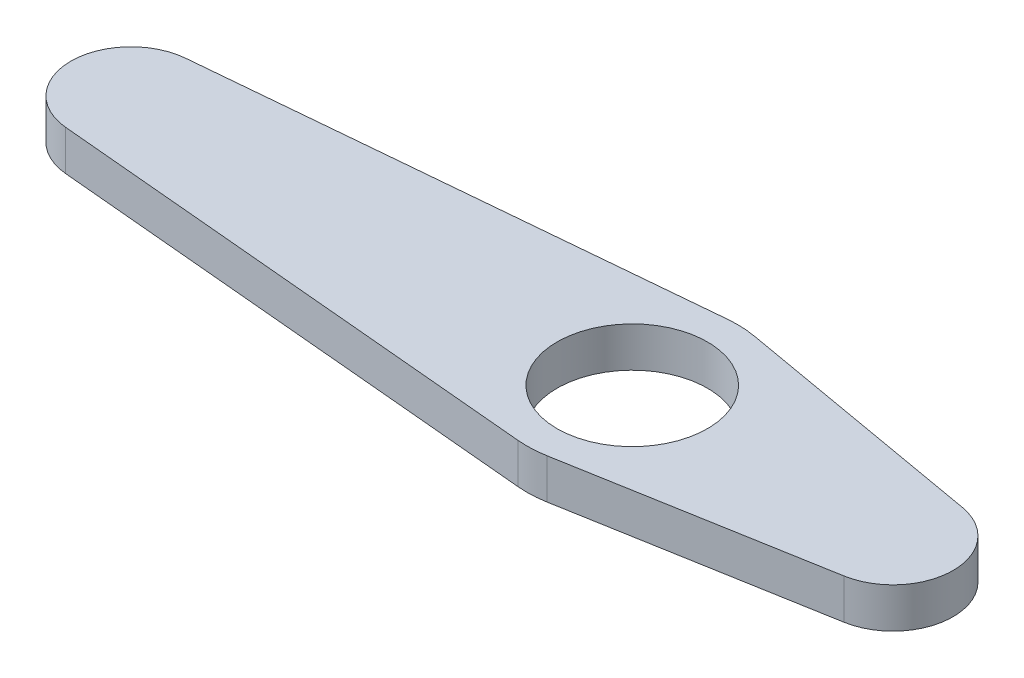
ISO-10303-21;
HEADER;
FILE_DESCRIPTION(('STEP AP214'),'2;1');
FILE_NAME('part.step','',(''),(''),'','','');
FILE_SCHEMA(('AUTOMOTIVE_DESIGN { 1 0 10303 214 1 1 1 1 }'));
ENDSEC;
DATA;
#1=APPLICATION_CONTEXT('core data for automotive mechanical design processes');
#2=APPLICATION_PROTOCOL_DEFINITION('international standard','automotive_design',2000,#1);
#3=PRODUCT_CONTEXT('',#1,'mechanical');
#4=PRODUCT('Part','Part','',(#3));
#5=PRODUCT_RELATED_PRODUCT_CATEGORY('part','',(#4));
#6=PRODUCT_DEFINITION_FORMATION('','',#4);
#7=PRODUCT_DEFINITION_CONTEXT('part definition',#1,'design');
#8=PRODUCT_DEFINITION('design','',#6,#7);
#9=PRODUCT_DEFINITION_SHAPE('','',#8);
#10=(LENGTH_UNIT() NAMED_UNIT(*) SI_UNIT(.MILLI.,.METRE.));
#11=(NAMED_UNIT(*) PLANE_ANGLE_UNIT() SI_UNIT($,.RADIAN.));
#12=(NAMED_UNIT(*) SI_UNIT($,.STERADIAN.) SOLID_ANGLE_UNIT());
#13=UNCERTAINTY_MEASURE_WITH_UNIT(LENGTH_MEASURE(1.E-05),#10,'distance_accuracy_value','');
#14=(GEOMETRIC_REPRESENTATION_CONTEXT(3) GLOBAL_UNCERTAINTY_ASSIGNED_CONTEXT((#13)) GLOBAL_UNIT_ASSIGNED_CONTEXT((#10,
#11,#12)) REPRESENTATION_CONTEXT('',''));
#15=CARTESIAN_POINT('',(0.,0.,0.));
#16=DIRECTION('',(0.,0.,1.));
#17=DIRECTION('',(1.,0.,0.));
#18=AXIS2_PLACEMENT_3D('',#15,#16,#17);
#19=CARTESIAN_POINT('',(-25.,1.,0.));
#20=DIRECTION('',(0.,-1.,0.));
#21=DIRECTION('',(0.,0.,-1.));
#22=AXIS2_PLACEMENT_3D('',#19,#20,#21);
#23=PLANE('',#22);
#24=CARTESIAN_POINT('',(-25.,1.,0.));
#25=DIRECTION('',(0.,1.,0.));
#26=DIRECTION('',(0.,0.,-1.));
#27=AXIS2_PLACEMENT_3D('',#24,#25,#26);
#28=CIRCLE('',#27,3.);
#29=CARTESIAN_POINT('',(-25.27,1.,-2.98782529609748));
#30=VERTEX_POINT('',#29);
#31=CARTESIAN_POINT('',(-25.27,1.,2.98782529609748));
#32=VERTEX_POINT('',#31);
#33=EDGE_CURVE('E151',#30,#32,#28,.T.);
#34=ORIENTED_EDGE('',*,*,#33,.T.);
#35=DIRECTION('',(0.995941765365827,0.,0.09));
#36=VECTOR('',#35,1.);
#37=CARTESIAN_POINT('',(-25.27,1.,2.98782529609748));
#38=LINE('',#37,#36);
#39=CARTESIAN_POINT('',(-0.4725,1.,5.22869426817059));
#40=VERTEX_POINT('',#39);
#41=EDGE_CURVE('E99',#32,#40,#38,.T.);
#42=ORIENTED_EDGE('',*,*,#41,.T.);
#43=CARTESIAN_POINT('',(0.,1.,0.));
#44=DIRECTION('',(0.,1.,0.));
#45=DIRECTION('',(0.,0.,1.));
#46=AXIS2_PLACEMENT_3D('',#43,#44,#45);
#47=CIRCLE('',#46,5.25);
#48=CARTESIAN_POINT('',(0.908653846153847,1.,5.17076862641038));
#49=VERTEX_POINT('',#48);
#50=EDGE_CURVE('E166',#40,#49,#47,.T.);
#51=ORIENTED_EDGE('',*,*,#50,.T.);
#52=DIRECTION('',(0.984908309792452,0.,-0.173076923076924));
#53=VECTOR('',#52,1.);
#54=CARTESIAN_POINT('',(0.90865384615385,1.,5.17076862641038));
#55=LINE('',#54,#53);
#56=CARTESIAN_POINT('',(13.5192307692308,1.,2.95472492937736));
#57=VERTEX_POINT('',#56);
#58=EDGE_CURVE('E179',#49,#57,#55,.T.);
#59=ORIENTED_EDGE('',*,*,#58,.T.);
#60=CARTESIAN_POINT('',(13.,1.,0.));
#61=DIRECTION('',(0.,1.,0.));
#62=DIRECTION('',(0.,0.,-1.));
#63=AXIS2_PLACEMENT_3D('',#60,#61,#62);
#64=CIRCLE('',#63,3.);
#65=CARTESIAN_POINT('',(13.5192307692308,1.,-2.95472492937736));
#66=VERTEX_POINT('',#65);
#67=EDGE_CURVE('E118',#57,#66,#64,.T.);
#68=ORIENTED_EDGE('',*,*,#67,.T.);
#69=DIRECTION('',(-0.984908309792452,0.,-0.173076923076923));
#70=VECTOR('',#69,1.);
#71=CARTESIAN_POINT('',(0.908653846153846,1.,-5.17076862641037));
#72=LINE('',#71,#70);
#73=CARTESIAN_POINT('',(0.908653846153846,1.,-5.17076862641037));
#74=VERTEX_POINT('',#73);
#75=EDGE_CURVE('E112',#66,#74,#72,.T.);
#76=ORIENTED_EDGE('',*,*,#75,.T.);
#77=CARTESIAN_POINT('',(0.,1.,0.));
#78=DIRECTION('',(0.,1.,0.));
#79=DIRECTION('',(0.,0.,-1.));
#80=AXIS2_PLACEMENT_3D('',#77,#78,#79);
#81=CIRCLE('',#80,5.25);
#82=CARTESIAN_POINT('',(-0.472500000000002,1.,-5.22869426817059));
#83=VERTEX_POINT('',#82);
#84=EDGE_CURVE('E116',#74,#83,#81,.T.);
#85=ORIENTED_EDGE('',*,*,#84,.T.);
#86=DIRECTION('',(-0.995941765365827,0.,0.09));
#87=VECTOR('',#86,1.);
#88=CARTESIAN_POINT('',(-0.472499999999999,1.,-5.22869426817059));
#89=LINE('',#88,#87);
#90=EDGE_CURVE('E56',#83,#30,#89,.T.);
#91=ORIENTED_EDGE('',*,*,#90,.T.);
#92=EDGE_LOOP('',(#34,#42,#51,#59,#68,#76,#85,#91));
#93=FACE_BOUND('',#92,.T.);
#94=CARTESIAN_POINT('',(0.,1.,0.));
#95=DIRECTION('',(0.,1.,0.));
#96=DIRECTION('',(0.,0.,1.));
#97=AXIS2_PLACEMENT_3D('',#94,#95,#96);
#98=CIRCLE('',#97,3.75);
#99=CARTESIAN_POINT('',(0.,1.,3.75));
#100=VERTEX_POINT('',#99);
#101=EDGE_CURVE('E140',#100,#100,#98,.T.);
#102=ORIENTED_EDGE('',*,*,#101,.F.);
#103=EDGE_LOOP('',(#102));
#104=FACE_BOUND('',#103,.T.);
#105=ADVANCED_FACE('F39',(#93,#104),#23,.F.);
#106=CARTESIAN_POINT('',(-25.,-1.,0.));
#107=DIRECTION('',(0.,-1.,0.));
#108=DIRECTION('',(0.,0.,-1.));
#109=AXIS2_PLACEMENT_3D('',#106,#107,#108);
#110=PLANE('',#109);
#111=CARTESIAN_POINT('',(-25.,-1.,0.));
#112=DIRECTION('',(0.,1.,0.));
#113=DIRECTION('',(0.,0.,-1.));
#114=AXIS2_PLACEMENT_3D('',#111,#112,#113);
#115=CIRCLE('',#114,3.);
#116=CARTESIAN_POINT('',(-25.27,-1.,-2.98782529609748));
#117=VERTEX_POINT('',#116);
#118=CARTESIAN_POINT('',(-25.27,-1.,2.98782529609748));
#119=VERTEX_POINT('',#118);
#120=EDGE_CURVE('E136',#117,#119,#115,.T.);
#121=ORIENTED_EDGE('',*,*,#120,.F.);
#122=DIRECTION('',(-0.995941765365827,0.,0.09));
#123=VECTOR('',#122,1.);
#124=CARTESIAN_POINT('',(-0.472499999999999,-1.,-5.22869426817059));
#125=LINE('',#124,#123);
#126=CARTESIAN_POINT('',(-0.472500000000002,-1.,-5.22869426817059));
#127=VERTEX_POINT('',#126);
#128=EDGE_CURVE('E91',#127,#117,#125,.T.);
#129=ORIENTED_EDGE('',*,*,#128,.F.);
#130=CARTESIAN_POINT('',(0.,-1.,0.));
#131=DIRECTION('',(0.,1.,0.));
#132=DIRECTION('',(0.,0.,-1.));
#133=AXIS2_PLACEMENT_3D('',#130,#131,#132);
#134=CIRCLE('',#133,5.25);
#135=CARTESIAN_POINT('',(0.908653846153846,-1.,-5.17076862641037));
#136=VERTEX_POINT('',#135);
#137=EDGE_CURVE('E85',#136,#127,#134,.T.);
#138=ORIENTED_EDGE('',*,*,#137,.F.);
#139=DIRECTION('',(-0.984908309792452,0.,-0.173076923076923));
#140=VECTOR('',#139,1.);
#141=CARTESIAN_POINT('',(0.908653846153846,-1.,-5.17076862641037));
#142=LINE('',#141,#140);
#143=CARTESIAN_POINT('',(13.5192307692308,-1.,-2.95472492937736));
#144=VERTEX_POINT('',#143);
#145=EDGE_CURVE('E126',#144,#136,#142,.T.);
#146=ORIENTED_EDGE('',*,*,#145,.F.);
#147=CARTESIAN_POINT('',(13.,-1.,0.));
#148=DIRECTION('',(0.,1.,0.));
#149=DIRECTION('',(0.,0.,-1.));
#150=AXIS2_PLACEMENT_3D('',#147,#148,#149);
#151=CIRCLE('',#150,3.);
#152=CARTESIAN_POINT('',(13.5192307692308,-1.,2.95472492937736));
#153=VERTEX_POINT('',#152);
#154=EDGE_CURVE('E146',#153,#144,#151,.T.);
#155=ORIENTED_EDGE('',*,*,#154,.F.);
#156=DIRECTION('',(0.984908309792452,0.,-0.173076923076924));
#157=VECTOR('',#156,1.);
#158=CARTESIAN_POINT('',(0.90865384615385,-1.,5.17076862641038));
#159=LINE('',#158,#157);
#160=CARTESIAN_POINT('',(0.908653846153847,-1.,5.17076862641038));
#161=VERTEX_POINT('',#160);
#162=EDGE_CURVE('E144',#161,#153,#159,.T.);
#163=ORIENTED_EDGE('',*,*,#162,.F.);
#164=CARTESIAN_POINT('',(0.,-1.,0.));
#165=DIRECTION('',(0.,1.,0.));
#166=DIRECTION('',(0.,0.,1.));
#167=AXIS2_PLACEMENT_3D('',#164,#165,#166);
#168=CIRCLE('',#167,5.25);
#169=CARTESIAN_POINT('',(-0.4725,-1.,5.22869426817059));
#170=VERTEX_POINT('',#169);
#171=EDGE_CURVE('E142',#170,#161,#168,.T.);
#172=ORIENTED_EDGE('',*,*,#171,.F.);
#173=DIRECTION('',(0.995941765365827,0.,0.09));
#174=VECTOR('',#173,1.);
#175=CARTESIAN_POINT('',(-25.27,-1.,2.98782529609748));
#176=LINE('',#175,#174);
#177=EDGE_CURVE('E139',#119,#170,#176,.T.);
#178=ORIENTED_EDGE('',*,*,#177,.F.);
#179=EDGE_LOOP('',(#121,#129,#138,#146,#155,#163,#172,#178));
#180=FACE_BOUND('',#179,.T.);
#181=CARTESIAN_POINT('',(0.,-1.,0.));
#182=DIRECTION('',(0.,1.,0.));
#183=DIRECTION('',(0.,0.,1.));
#184=AXIS2_PLACEMENT_3D('',#181,#182,#183);
#185=CIRCLE('',#184,3.75);
#186=CARTESIAN_POINT('',(0.,-1.,3.75));
#187=VERTEX_POINT('',#186);
#188=EDGE_CURVE('E185',#187,#187,#185,.T.);
#189=ORIENTED_EDGE('',*,*,#188,.T.);
#190=EDGE_LOOP('',(#189));
#191=FACE_BOUND('',#190,.T.);
#192=ADVANCED_FACE('F170',(#180,#191),#110,.T.);
#193=CARTESIAN_POINT('',(-25.,1.,0.));
#194=DIRECTION('',(0.,-1.,0.));
#195=DIRECTION('',(0.,0.,-1.));
#196=AXIS2_PLACEMENT_3D('',#193,#194,#195);
#197=CYLINDRICAL_SURFACE('',#196,3.);
#198=ORIENTED_EDGE('',*,*,#120,.T.);
#199=DIRECTION('',(0.,-1.,0.));
#200=VECTOR('',#199,1.);
#201=CARTESIAN_POINT('',(-25.27,1.,2.98782529609748));
#202=LINE('',#201,#200);
#203=EDGE_CURVE('E11',#32,#119,#202,.T.);
#204=ORIENTED_EDGE('',*,*,#203,.F.);
#205=ORIENTED_EDGE('',*,*,#33,.F.);
#206=DIRECTION('',(0.,-1.,0.));
#207=VECTOR('',#206,1.);
#208=CARTESIAN_POINT('',(-25.27,1.,-2.98782529609748));
#209=LINE('',#208,#207);
#210=EDGE_CURVE('E132',#30,#117,#209,.T.);
#211=ORIENTED_EDGE('',*,*,#210,.T.);
#212=EDGE_LOOP('',(#198,#204,#205,#211));
#213=FACE_BOUND('',#212,.T.);
#214=ADVANCED_FACE('F41',(#213),#197,.T.);
#215=CARTESIAN_POINT('',(-25.27,1.,2.98782529609748));
#216=DIRECTION('',(0.09,0.,-0.995941765365827));
#217=DIRECTION('',(-0.995941765365827,0.,-0.09));
#218=AXIS2_PLACEMENT_3D('',#215,#216,#217);
#219=PLANE('',#218);
#220=ORIENTED_EDGE('',*,*,#177,.T.);
#221=DIRECTION('',(0.,-1.,0.));
#222=VECTOR('',#221,1.);
#223=CARTESIAN_POINT('',(-0.4725,1.,5.22869426817059));
#224=LINE('',#223,#222);
#225=EDGE_CURVE('E48',#40,#170,#224,.T.);
#226=ORIENTED_EDGE('',*,*,#225,.F.);
#227=ORIENTED_EDGE('',*,*,#41,.F.);
#228=ORIENTED_EDGE('',*,*,#203,.T.);
#229=EDGE_LOOP('',(#220,#226,#227,#228));
#230=FACE_BOUND('',#229,.T.);
#231=ADVANCED_FACE('F213',(#230),#219,.F.);
#232=CARTESIAN_POINT('',(0.,1.,0.));
#233=DIRECTION('',(0.,-1.,0.));
#234=DIRECTION('',(0.,0.,-1.));
#235=AXIS2_PLACEMENT_3D('',#232,#233,#234);
#236=CYLINDRICAL_SURFACE('',#235,5.25);
#237=ORIENTED_EDGE('',*,*,#171,.T.);
#238=DIRECTION('',(0.,-1.,0.));
#239=VECTOR('',#238,1.);
#240=CARTESIAN_POINT('',(0.908653846153847,1.,5.17076862641038));
#241=LINE('',#240,#239);
#242=EDGE_CURVE('E158',#49,#161,#241,.T.);
#243=ORIENTED_EDGE('',*,*,#242,.F.);
#244=ORIENTED_EDGE('',*,*,#50,.F.);
#245=ORIENTED_EDGE('',*,*,#225,.T.);
#246=EDGE_LOOP('',(#237,#243,#244,#245));
#247=FACE_BOUND('',#246,.T.);
#248=ADVANCED_FACE('F164',(#247),#236,.T.);
#249=CARTESIAN_POINT('',(0.90865384615385,1.,5.17076862641038));
#250=DIRECTION('',(-0.173076923076924,0.,-0.984908309792452));
#251=DIRECTION('',(-0.984908309792452,0.,0.173076923076924));
#252=AXIS2_PLACEMENT_3D('',#249,#250,#251);
#253=PLANE('',#252);
#254=ORIENTED_EDGE('',*,*,#162,.T.);
#255=DIRECTION('',(0.,-1.,0.));
#256=VECTOR('',#255,1.);
#257=CARTESIAN_POINT('',(13.5192307692308,1.,2.95472492937736));
#258=LINE('',#257,#256);
#259=EDGE_CURVE('E155',#57,#153,#258,.T.);
#260=ORIENTED_EDGE('',*,*,#259,.F.);
#261=ORIENTED_EDGE('',*,*,#58,.F.);
#262=ORIENTED_EDGE('',*,*,#242,.T.);
#263=EDGE_LOOP('',(#254,#260,#261,#262));
#264=FACE_BOUND('',#263,.T.);
#265=ADVANCED_FACE('F175',(#264),#253,.F.);
#266=CARTESIAN_POINT('',(13.,1.,0.));
#267=DIRECTION('',(0.,-1.,0.));
#268=DIRECTION('',(0.,0.,-1.));
#269=AXIS2_PLACEMENT_3D('',#266,#267,#268);
#270=CYLINDRICAL_SURFACE('',#269,3.);
#271=ORIENTED_EDGE('',*,*,#154,.T.);
#272=DIRECTION('',(0.,-1.,0.));
#273=VECTOR('',#272,1.);
#274=CARTESIAN_POINT('',(13.5192307692308,1.,-2.95472492937736));
#275=LINE('',#274,#273);
#276=EDGE_CURVE('E127',#66,#144,#275,.T.);
#277=ORIENTED_EDGE('',*,*,#276,.F.);
#278=ORIENTED_EDGE('',*,*,#67,.F.);
#279=ORIENTED_EDGE('',*,*,#259,.T.);
#280=EDGE_LOOP('',(#271,#277,#278,#279));
#281=FACE_BOUND('',#280,.T.);
#282=ADVANCED_FACE('F178',(#281),#270,.T.);
#283=CARTESIAN_POINT('',(0.908653846153846,1.,-5.17076862641037));
#284=DIRECTION('',(-0.173076923076923,0.,0.984908309792452));
#285=DIRECTION('',(0.984908309792452,0.,0.173076923076923));
#286=AXIS2_PLACEMENT_3D('',#283,#284,#285);
#287=PLANE('',#286);
#288=ORIENTED_EDGE('',*,*,#145,.T.);
#289=DIRECTION('',(0.,-1.,0.));
#290=VECTOR('',#289,1.);
#291=CARTESIAN_POINT('',(0.908653846153846,1.,-5.17076862641037));
#292=LINE('',#291,#290);
#293=EDGE_CURVE('E123',#74,#136,#292,.T.);
#294=ORIENTED_EDGE('',*,*,#293,.F.);
#295=ORIENTED_EDGE('',*,*,#75,.F.);
#296=ORIENTED_EDGE('',*,*,#276,.T.);
#297=EDGE_LOOP('',(#288,#294,#295,#296));
#298=FACE_BOUND('',#297,.T.);
#299=ADVANCED_FACE('F124',(#298),#287,.F.);
#300=CARTESIAN_POINT('',(0.,1.,0.));
#301=DIRECTION('',(0.,-1.,0.));
#302=DIRECTION('',(0.,0.,-1.));
#303=AXIS2_PLACEMENT_3D('',#300,#301,#302);
#304=CYLINDRICAL_SURFACE('',#303,5.25);
#305=ORIENTED_EDGE('',*,*,#137,.T.);
#306=DIRECTION('',(0.,-1.,0.));
#307=VECTOR('',#306,1.);
#308=CARTESIAN_POINT('',(-0.472500000000002,1.,-5.22869426817059));
#309=LINE('',#308,#307);
#310=EDGE_CURVE('E128',#83,#127,#309,.T.);
#311=ORIENTED_EDGE('',*,*,#310,.F.);
#312=ORIENTED_EDGE('',*,*,#84,.F.);
#313=ORIENTED_EDGE('',*,*,#293,.T.);
#314=EDGE_LOOP('',(#305,#311,#312,#313));
#315=FACE_BOUND('',#314,.T.);
#316=ADVANCED_FACE('F130',(#315),#304,.T.);
#317=CARTESIAN_POINT('',(-0.472499999999999,1.,-5.22869426817059));
#318=DIRECTION('',(0.09,0.,0.995941765365827));
#319=DIRECTION('',(0.995941765365827,0.,-0.09));
#320=AXIS2_PLACEMENT_3D('',#317,#318,#319);
#321=PLANE('',#320);
#322=ORIENTED_EDGE('',*,*,#128,.T.);
#323=ORIENTED_EDGE('',*,*,#210,.F.);
#324=ORIENTED_EDGE('',*,*,#90,.F.);
#325=ORIENTED_EDGE('',*,*,#310,.T.);
#326=EDGE_LOOP('',(#322,#323,#324,#325));
#327=FACE_BOUND('',#326,.T.);
#328=ADVANCED_FACE('F201',(#327),#321,.F.);
#329=CARTESIAN_POINT('',(0.,1.,0.));
#330=DIRECTION('',(0.,-1.,0.));
#331=DIRECTION('',(0.,0.,-1.));
#332=AXIS2_PLACEMENT_3D('',#329,#330,#331);
#333=CYLINDRICAL_SURFACE('',#332,3.75);
#334=ORIENTED_EDGE('',*,*,#101,.T.);
#335=EDGE_LOOP('',(#334));
#336=FACE_BOUND('',#335,.T.);
#337=ORIENTED_EDGE('',*,*,#188,.F.);
#338=EDGE_LOOP('',(#337));
#339=FACE_BOUND('',#338,.T.);
#340=ADVANCED_FACE('F191',(#336,#339),#333,.F.);
#341=CLOSED_SHELL('',(#105,#192,#214,#231,#248,#265,#282,#299,#316,#328,#340));
#342=MANIFOLD_SOLID_BREP('B2',#341);
#343=ADVANCED_BREP_SHAPE_REPRESENTATION('',(#18,#342),#14);
#344=SHAPE_DEFINITION_REPRESENTATION(#9,#343);
ENDSEC;
END-ISO-10303-21;
